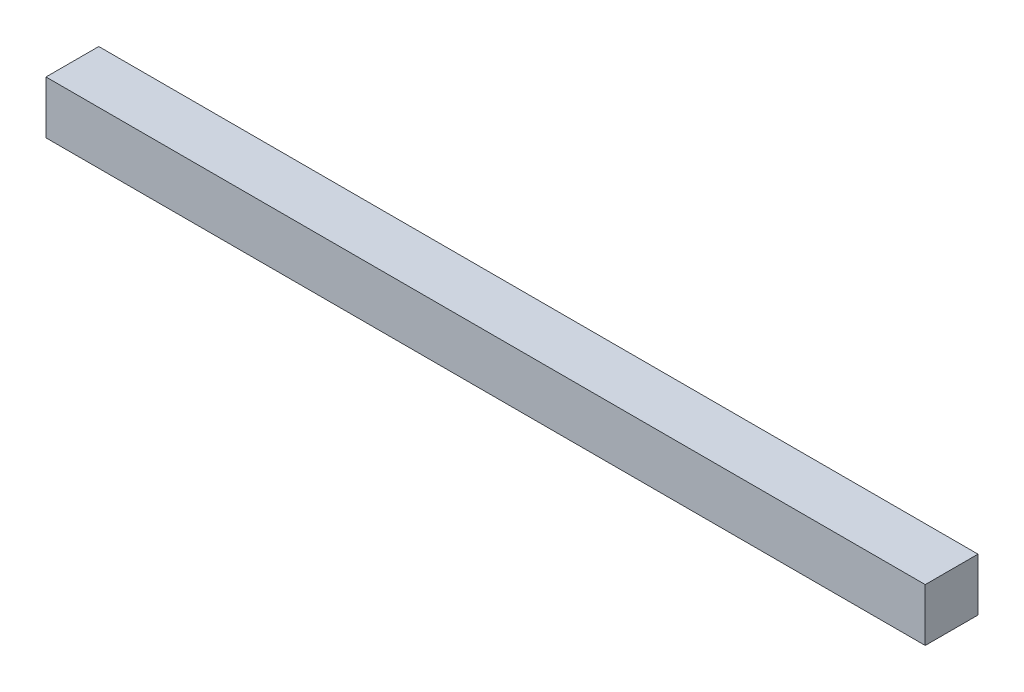
ISO-10303-21;
HEADER;
FILE_DESCRIPTION(('STEP AP214'),'2;1');
FILE_NAME('part.step','',(''),(''),'','','');
FILE_SCHEMA(('AUTOMOTIVE_DESIGN { 1 0 10303 214 1 1 1 1 }'));
ENDSEC;
DATA;
#1=APPLICATION_CONTEXT('core data for automotive mechanical design processes');
#2=APPLICATION_PROTOCOL_DEFINITION('international standard','automotive_design',2000,#1);
#3=PRODUCT_CONTEXT('',#1,'mechanical');
#4=PRODUCT('Part','Part','',(#3));
#5=PRODUCT_RELATED_PRODUCT_CATEGORY('part','',(#4));
#6=PRODUCT_DEFINITION_FORMATION('','',#4);
#7=PRODUCT_DEFINITION_CONTEXT('part definition',#1,'design');
#8=PRODUCT_DEFINITION('design','',#6,#7);
#9=PRODUCT_DEFINITION_SHAPE('','',#8);
#10=(LENGTH_UNIT() NAMED_UNIT(*) SI_UNIT(.MILLI.,.METRE.));
#11=(NAMED_UNIT(*) PLANE_ANGLE_UNIT() SI_UNIT($,.RADIAN.));
#12=(NAMED_UNIT(*) SI_UNIT($,.STERADIAN.) SOLID_ANGLE_UNIT());
#13=UNCERTAINTY_MEASURE_WITH_UNIT(LENGTH_MEASURE(1.E-05),#10,'distance_accuracy_value','');
#14=(GEOMETRIC_REPRESENTATION_CONTEXT(3) GLOBAL_UNCERTAINTY_ASSIGNED_CONTEXT((#13)) GLOBAL_UNIT_ASSIGNED_CONTEXT((#10,
#11,#12)) REPRESENTATION_CONTEXT('',''));
#15=CARTESIAN_POINT('',(0.,0.,0.));
#16=DIRECTION('',(0.,0.,1.));
#17=DIRECTION('',(1.,0.,0.));
#18=AXIS2_PLACEMENT_3D('',#15,#16,#17);
#19=CARTESIAN_POINT('',(500.,-15.,-15.));
#20=DIRECTION('',(0.,0.,1.));
#21=DIRECTION('',(1.,0.,0.));
#22=AXIS2_PLACEMENT_3D('',#19,#20,#21);
#23=PLANE('',#22);
#24=DIRECTION('',(0.,1.,0.));
#25=VECTOR('',#24,1.);
#26=CARTESIAN_POINT('',(0.,-15.,-15.));
#27=LINE('',#26,#25);
#28=CARTESIAN_POINT('',(0.,-15.,-15.));
#29=VERTEX_POINT('',#28);
#30=CARTESIAN_POINT('',(0.,15.,-15.));
#31=VERTEX_POINT('',#30);
#32=EDGE_CURVE('E100',#29,#31,#27,.T.);
#33=ORIENTED_EDGE('',*,*,#32,.T.);
#34=DIRECTION('',(-1.,0.,0.));
#35=VECTOR('',#34,1.);
#36=CARTESIAN_POINT('',(500.,15.,-15.));
#37=LINE('',#36,#35);
#38=CARTESIAN_POINT('',(500.,15.,-15.));
#39=VERTEX_POINT('',#38);
#40=EDGE_CURVE('E11',#39,#31,#37,.T.);
#41=ORIENTED_EDGE('',*,*,#40,.F.);
#42=DIRECTION('',(0.,1.,0.));
#43=VECTOR('',#42,1.);
#44=CARTESIAN_POINT('',(500.,-15.,-15.));
#45=LINE('',#44,#43);
#46=CARTESIAN_POINT('',(500.,-15.,-15.));
#47=VERTEX_POINT('',#46);
#48=EDGE_CURVE('E88',#47,#39,#45,.T.);
#49=ORIENTED_EDGE('',*,*,#48,.F.);
#50=DIRECTION('',(-1.,0.,0.));
#51=VECTOR('',#50,1.);
#52=CARTESIAN_POINT('',(500.,-15.,-15.));
#53=LINE('',#52,#51);
#54=EDGE_CURVE('E96',#47,#29,#53,.T.);
#55=ORIENTED_EDGE('',*,*,#54,.T.);
#56=EDGE_LOOP('',(#33,#41,#49,#55));
#57=FACE_BOUND('',#56,.T.);
#58=ADVANCED_FACE('F37',(#57),#23,.F.);
#59=CARTESIAN_POINT('',(500.,15.,15.));
#60=DIRECTION('',(0.,-1.,0.));
#61=DIRECTION('',(0.,0.,-1.));
#62=AXIS2_PLACEMENT_3D('',#59,#60,#61);
#63=PLANE('',#62);
#64=DIRECTION('',(0.,0.,1.));
#65=VECTOR('',#64,1.);
#66=CARTESIAN_POINT('',(0.,15.,15.));
#67=LINE('',#66,#65);
#68=CARTESIAN_POINT('',(0.,15.,15.));
#69=VERTEX_POINT('',#68);
#70=EDGE_CURVE('E92',#31,#69,#67,.T.);
#71=ORIENTED_EDGE('',*,*,#70,.T.);
#72=DIRECTION('',(-1.,0.,0.));
#73=VECTOR('',#72,1.);
#74=CARTESIAN_POINT('',(500.,15.,15.));
#75=LINE('',#74,#73);
#76=CARTESIAN_POINT('',(500.,15.,15.));
#77=VERTEX_POINT('',#76);
#78=EDGE_CURVE('E45',#77,#69,#75,.T.);
#79=ORIENTED_EDGE('',*,*,#78,.F.);
#80=DIRECTION('',(0.,0.,1.));
#81=VECTOR('',#80,1.);
#82=CARTESIAN_POINT('',(500.,15.,15.));
#83=LINE('',#82,#81);
#84=EDGE_CURVE('E83',#39,#77,#83,.T.);
#85=ORIENTED_EDGE('',*,*,#84,.F.);
#86=ORIENTED_EDGE('',*,*,#40,.T.);
#87=EDGE_LOOP('',(#71,#79,#85,#86));
#88=FACE_BOUND('',#87,.T.);
#89=ADVANCED_FACE('F91',(#88),#63,.F.);
#90=CARTESIAN_POINT('',(500.,-15.,15.));
#91=DIRECTION('',(0.,0.,-1.));
#92=DIRECTION('',(-1.,0.,0.));
#93=AXIS2_PLACEMENT_3D('',#90,#91,#92);
#94=PLANE('',#93);
#95=DIRECTION('',(0.,-1.,0.));
#96=VECTOR('',#95,1.);
#97=CARTESIAN_POINT('',(0.,-15.,15.));
#98=LINE('',#97,#96);
#99=CARTESIAN_POINT('',(0.,-15.,15.));
#100=VERTEX_POINT('',#99);
#101=EDGE_CURVE('E70',#69,#100,#98,.T.);
#102=ORIENTED_EDGE('',*,*,#101,.T.);
#103=DIRECTION('',(-1.,0.,0.));
#104=VECTOR('',#103,1.);
#105=CARTESIAN_POINT('',(500.,-15.,15.));
#106=LINE('',#105,#104);
#107=CARTESIAN_POINT('',(500.,-15.,15.));
#108=VERTEX_POINT('',#107);
#109=EDGE_CURVE('E93',#108,#100,#106,.T.);
#110=ORIENTED_EDGE('',*,*,#109,.F.);
#111=DIRECTION('',(0.,-1.,0.));
#112=VECTOR('',#111,1.);
#113=CARTESIAN_POINT('',(500.,-15.,15.));
#114=LINE('',#113,#112);
#115=EDGE_CURVE('E86',#77,#108,#114,.T.);
#116=ORIENTED_EDGE('',*,*,#115,.F.);
#117=ORIENTED_EDGE('',*,*,#78,.T.);
#118=EDGE_LOOP('',(#102,#110,#116,#117));
#119=FACE_BOUND('',#118,.T.);
#120=ADVANCED_FACE('F94',(#119),#94,.F.);
#121=CARTESIAN_POINT('',(500.,-15.,15.));
#122=DIRECTION('',(0.,1.,0.));
#123=DIRECTION('',(0.,0.,1.));
#124=AXIS2_PLACEMENT_3D('',#121,#122,#123);
#125=PLANE('',#124);
#126=DIRECTION('',(0.,0.,-1.));
#127=VECTOR('',#126,1.);
#128=CARTESIAN_POINT('',(0.,-15.,15.));
#129=LINE('',#128,#127);
#130=EDGE_CURVE('E76',#100,#29,#129,.T.);
#131=ORIENTED_EDGE('',*,*,#130,.T.);
#132=ORIENTED_EDGE('',*,*,#54,.F.);
#133=DIRECTION('',(0.,0.,-1.));
#134=VECTOR('',#133,1.);
#135=CARTESIAN_POINT('',(500.,-15.,15.));
#136=LINE('',#135,#134);
#137=EDGE_CURVE('E53',#108,#47,#136,.T.);
#138=ORIENTED_EDGE('',*,*,#137,.F.);
#139=ORIENTED_EDGE('',*,*,#109,.T.);
#140=EDGE_LOOP('',(#131,#132,#138,#139));
#141=FACE_BOUND('',#140,.T.);
#142=ADVANCED_FACE('F107',(#141),#125,.F.);
#143=CARTESIAN_POINT('',(500.,0.,0.));
#144=DIRECTION('',(-1.,0.,0.));
#145=DIRECTION('',(0.,0.,1.));
#146=AXIS2_PLACEMENT_3D('',#143,#144,#145);
#147=PLANE('',#146);
#148=ORIENTED_EDGE('',*,*,#48,.T.);
#149=ORIENTED_EDGE('',*,*,#84,.T.);
#150=ORIENTED_EDGE('',*,*,#115,.T.);
#151=ORIENTED_EDGE('',*,*,#137,.T.);
#152=EDGE_LOOP('',(#148,#149,#150,#151));
#153=FACE_BOUND('',#152,.T.);
#154=ADVANCED_FACE('F84',(#153),#147,.F.);
#155=CARTESIAN_POINT('',(0.,0.,0.));
#156=DIRECTION('',(-1.,0.,0.));
#157=DIRECTION('',(0.,0.,1.));
#158=AXIS2_PLACEMENT_3D('',#155,#156,#157);
#159=PLANE('',#158);
#160=ORIENTED_EDGE('',*,*,#32,.F.);
#161=ORIENTED_EDGE('',*,*,#130,.F.);
#162=ORIENTED_EDGE('',*,*,#101,.F.);
#163=ORIENTED_EDGE('',*,*,#70,.F.);
#164=EDGE_LOOP('',(#160,#161,#162,#163));
#165=FACE_BOUND('',#164,.T.);
#166=ADVANCED_FACE('F110',(#165),#159,.T.);
#167=CLOSED_SHELL('',(#58,#89,#120,#142,#154,#166));
#168=MANIFOLD_SOLID_BREP('B2',#167);
#169=ADVANCED_BREP_SHAPE_REPRESENTATION('',(#18,#168),#14);
#170=SHAPE_DEFINITION_REPRESENTATION(#9,#169);
ENDSEC;
END-ISO-10303-21;
